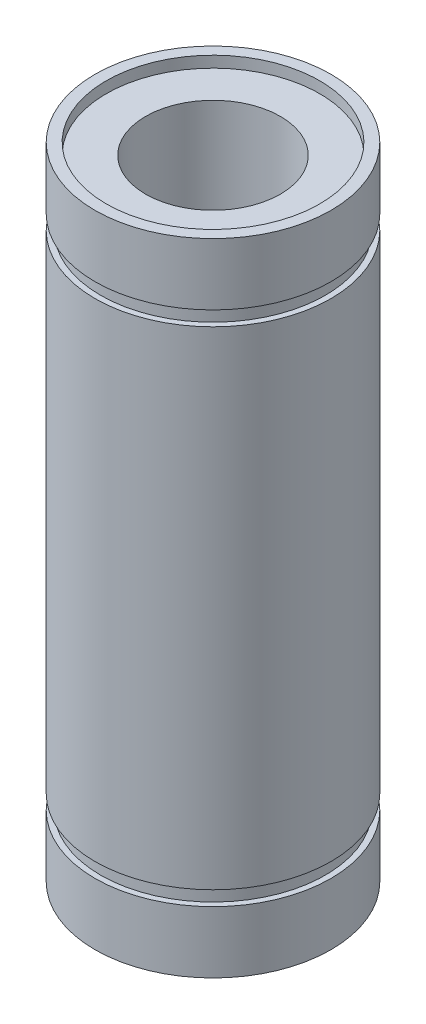
ISO-10303-21;
HEADER;
FILE_DESCRIPTION(('STEP AP214'),'2;1');
FILE_NAME('part.step','',(''),(''),'','','');
FILE_SCHEMA(('AUTOMOTIVE_DESIGN { 1 0 10303 214 1 1 1 1 }'));
ENDSEC;
DATA;
#1=APPLICATION_CONTEXT('core data for automotive mechanical design processes');
#2=APPLICATION_PROTOCOL_DEFINITION('international standard','automotive_design',2000,#1);
#3=PRODUCT_CONTEXT('',#1,'mechanical');
#4=PRODUCT('Part','Part','',(#3));
#5=PRODUCT_RELATED_PRODUCT_CATEGORY('part','',(#4));
#6=PRODUCT_DEFINITION_FORMATION('','',#4);
#7=PRODUCT_DEFINITION_CONTEXT('part definition',#1,'design');
#8=PRODUCT_DEFINITION('design','',#6,#7);
#9=PRODUCT_DEFINITION_SHAPE('','',#8);
#10=(LENGTH_UNIT() NAMED_UNIT(*) SI_UNIT(.MILLI.,.METRE.));
#11=(NAMED_UNIT(*) PLANE_ANGLE_UNIT() SI_UNIT($,.RADIAN.));
#12=(NAMED_UNIT(*) SI_UNIT($,.STERADIAN.) SOLID_ANGLE_UNIT());
#13=UNCERTAINTY_MEASURE_WITH_UNIT(LENGTH_MEASURE(1.E-05),#10,'distance_accuracy_value','');
#14=(GEOMETRIC_REPRESENTATION_CONTEXT(3) GLOBAL_UNCERTAINTY_ASSIGNED_CONTEXT((#13)) GLOBAL_UNIT_ASSIGNED_CONTEXT((#10,
#11,#12)) REPRESENTATION_CONTEXT('',''));
#15=CARTESIAN_POINT('',(0.,0.,0.));
#16=DIRECTION('',(0.,0.,1.));
#17=DIRECTION('',(1.,0.,0.));
#18=AXIS2_PLACEMENT_3D('',#15,#16,#17);
#19=CARTESIAN_POINT('',(0.,57.,0.));
#20=DIRECTION('',(0.,-1.,0.));
#21=DIRECTION('',(0.,0.,-1.));
#22=AXIS2_PLACEMENT_3D('',#19,#20,#21);
#23=CYLINDRICAL_SURFACE('',#22,10.5);
#24=CARTESIAN_POINT('',(0.,50.2,0.));
#25=DIRECTION('',(0.,1.,0.));
#26=DIRECTION('',(0.,0.,1.));
#27=AXIS2_PLACEMENT_3D('',#24,#25,#26);
#28=CIRCLE('',#27,10.5);
#29=CARTESIAN_POINT('',(0.,50.2,10.5));
#30=VERTEX_POINT('',#29);
#31=EDGE_CURVE('E72',#30,#30,#28,.T.);
#32=ORIENTED_EDGE('',*,*,#31,.F.);
#33=EDGE_LOOP('',(#32));
#34=FACE_BOUND('',#33,.T.);
#35=CARTESIAN_POINT('',(0.,6.8,0.));
#36=DIRECTION('',(0.,-1.,0.));
#37=DIRECTION('',(0.,0.,-1.));
#38=AXIS2_PLACEMENT_3D('',#35,#36,#37);
#39=CIRCLE('',#38,10.5);
#40=CARTESIAN_POINT('',(0.,6.8,-10.5));
#41=VERTEX_POINT('',#40);
#42=EDGE_CURVE('E47',#41,#41,#39,.T.);
#43=ORIENTED_EDGE('',*,*,#42,.F.);
#44=EDGE_LOOP('',(#43));
#45=FACE_BOUND('',#44,.T.);
#46=ADVANCED_FACE('F43',(#34,#45),#23,.T.);
#47=CARTESIAN_POINT('',(0.,5.5,0.));
#48=DIRECTION('',(0.,-1.,0.));
#49=DIRECTION('',(0.,0.,-1.));
#50=AXIS2_PLACEMENT_3D('',#47,#48,#49);
#51=CIRCLE('',#50,10.5);
#52=CARTESIAN_POINT('',(0.,5.5,-10.5));
#53=VERTEX_POINT('',#52);
#54=EDGE_CURVE('E76',#53,#53,#51,.T.);
#55=ORIENTED_EDGE('',*,*,#54,.T.);
#56=EDGE_LOOP('',(#55));
#57=FACE_BOUND('',#56,.T.);
#58=CARTESIAN_POINT('',(0.,0.,0.));
#59=DIRECTION('',(0.,1.,0.));
#60=DIRECTION('',(0.,0.,1.));
#61=AXIS2_PLACEMENT_3D('',#58,#59,#60);
#62=CIRCLE('',#61,10.5);
#63=CARTESIAN_POINT('',(0.,0.,10.5));
#64=VERTEX_POINT('',#63);
#65=EDGE_CURVE('E51',#64,#64,#62,.T.);
#66=ORIENTED_EDGE('',*,*,#65,.T.);
#67=EDGE_LOOP('',(#66));
#68=FACE_BOUND('',#67,.T.);
#69=ADVANCED_FACE('F117',(#57,#68),#23,.T.);
#70=CARTESIAN_POINT('',(0.,57.,0.));
#71=DIRECTION('',(0.,-1.,0.));
#72=DIRECTION('',(0.,0.,-1.));
#73=AXIS2_PLACEMENT_3D('',#70,#71,#72);
#74=CYLINDRICAL_SURFACE('',#73,6.);
#75=CARTESIAN_POINT('',(0.,56.,0.));
#76=DIRECTION('',(0.,1.,0.));
#77=DIRECTION('',(0.,0.,1.));
#78=AXIS2_PLACEMENT_3D('',#75,#76,#77);
#79=CIRCLE('',#78,6.);
#80=CARTESIAN_POINT('',(0.,56.,6.));
#81=VERTEX_POINT('',#80);
#82=EDGE_CURVE('E56',#81,#81,#79,.T.);
#83=ORIENTED_EDGE('',*,*,#82,.T.);
#84=EDGE_LOOP('',(#83));
#85=FACE_BOUND('',#84,.T.);
#86=CARTESIAN_POINT('',(0.,1.,0.));
#87=DIRECTION('',(0.,-1.,0.));
#88=DIRECTION('',(0.,0.,-1.));
#89=AXIS2_PLACEMENT_3D('',#86,#87,#88);
#90=CIRCLE('',#89,6.);
#91=CARTESIAN_POINT('',(0.,1.,-6.));
#92=VERTEX_POINT('',#91);
#93=EDGE_CURVE('E65',#92,#92,#90,.T.);
#94=ORIENTED_EDGE('',*,*,#93,.T.);
#95=EDGE_LOOP('',(#94));
#96=FACE_BOUND('',#95,.T.);
#97=ADVANCED_FACE('F109',(#85,#96),#74,.F.);
#98=CARTESIAN_POINT('',(0.,57.,0.));
#99=DIRECTION('',(0.,1.,0.));
#100=DIRECTION('',(0.,0.,1.));
#101=AXIS2_PLACEMENT_3D('',#98,#99,#100);
#102=PLANE('',#101);
#103=CARTESIAN_POINT('',(0.,57.,0.));
#104=DIRECTION('',(0.,1.,0.));
#105=DIRECTION('',(0.,0.,1.));
#106=AXIS2_PLACEMENT_3D('',#103,#104,#105);
#107=CIRCLE('',#106,9.5);
#108=CARTESIAN_POINT('',(0.,57.,9.5));
#109=VERTEX_POINT('',#108);
#110=EDGE_CURVE('E59',#109,#109,#107,.T.);
#111=ORIENTED_EDGE('',*,*,#110,.F.);
#112=EDGE_LOOP('',(#111));
#113=FACE_BOUND('',#112,.T.);
#114=CARTESIAN_POINT('',(0.,57.,0.));
#115=DIRECTION('',(0.,1.,0.));
#116=DIRECTION('',(0.,0.,1.));
#117=AXIS2_PLACEMENT_3D('',#114,#115,#116);
#118=CIRCLE('',#117,10.5);
#119=CARTESIAN_POINT('',(0.,57.,10.5));
#120=VERTEX_POINT('',#119);
#121=EDGE_CURVE('E11',#120,#120,#118,.T.);
#122=ORIENTED_EDGE('',*,*,#121,.T.);
#123=EDGE_LOOP('',(#122));
#124=FACE_BOUND('',#123,.T.);
#125=ADVANCED_FACE('F106',(#113,#124),#102,.T.);
#126=CARTESIAN_POINT('',(0.,0.,0.));
#127=DIRECTION('',(0.,1.,0.));
#128=DIRECTION('',(0.,0.,1.));
#129=AXIS2_PLACEMENT_3D('',#126,#127,#128);
#130=PLANE('',#129);
#131=CARTESIAN_POINT('',(0.,0.,0.));
#132=DIRECTION('',(0.,-1.,0.));
#133=DIRECTION('',(0.,0.,-1.));
#134=AXIS2_PLACEMENT_3D('',#131,#132,#133);
#135=CIRCLE('',#134,9.5);
#136=CARTESIAN_POINT('',(0.,0.,-9.5));
#137=VERTEX_POINT('',#136);
#138=EDGE_CURVE('E75',#137,#137,#135,.T.);
#139=ORIENTED_EDGE('',*,*,#138,.F.);
#140=EDGE_LOOP('',(#139));
#141=FACE_BOUND('',#140,.T.);
#142=ORIENTED_EDGE('',*,*,#65,.F.);
#143=EDGE_LOOP('',(#142));
#144=FACE_BOUND('',#143,.T.);
#145=ADVANCED_FACE('F108',(#141,#144),#130,.F.);
#146=CARTESIAN_POINT('',(0.,51.5,0.));
#147=DIRECTION('',(0.,1.,0.));
#148=DIRECTION('',(0.,0.,1.));
#149=AXIS2_PLACEMENT_3D('',#146,#147,#148);
#150=CIRCLE('',#149,10.5);
#151=CARTESIAN_POINT('',(0.,51.5,10.5));
#152=VERTEX_POINT('',#151);
#153=EDGE_CURVE('E69',#152,#152,#150,.T.);
#154=ORIENTED_EDGE('',*,*,#153,.T.);
#155=EDGE_LOOP('',(#154));
#156=FACE_BOUND('',#155,.T.);
#157=ORIENTED_EDGE('',*,*,#121,.F.);
#158=EDGE_LOOP('',(#157));
#159=FACE_BOUND('',#158,.T.);
#160=ADVANCED_FACE('F45',(#156,#159),#23,.T.);
#161=CARTESIAN_POINT('',(0.,56.,0.));
#162=DIRECTION('',(0.,1.,0.));
#163=DIRECTION('',(0.,0.,1.));
#164=AXIS2_PLACEMENT_3D('',#161,#162,#163);
#165=CYLINDRICAL_SURFACE('',#164,9.5);
#166=CARTESIAN_POINT('',(0.,56.,0.));
#167=DIRECTION('',(0.,1.,0.));
#168=DIRECTION('',(0.,0.,1.));
#169=AXIS2_PLACEMENT_3D('',#166,#167,#168);
#170=CIRCLE('',#169,9.5);
#171=CARTESIAN_POINT('',(0.,56.,9.5));
#172=VERTEX_POINT('',#171);
#173=EDGE_CURVE('E64',#172,#172,#170,.T.);
#174=ORIENTED_EDGE('',*,*,#173,.F.);
#175=EDGE_LOOP('',(#174));
#176=FACE_BOUND('',#175,.T.);
#177=ORIENTED_EDGE('',*,*,#110,.T.);
#178=EDGE_LOOP('',(#177));
#179=FACE_BOUND('',#178,.T.);
#180=ADVANCED_FACE('F104',(#176,#179),#165,.F.);
#181=CARTESIAN_POINT('',(0.,56.,0.));
#182=DIRECTION('',(0.,1.,0.));
#183=DIRECTION('',(0.,0.,1.));
#184=AXIS2_PLACEMENT_3D('',#181,#182,#183);
#185=PLANE('',#184);
#186=ORIENTED_EDGE('',*,*,#82,.F.);
#187=EDGE_LOOP('',(#186));
#188=FACE_BOUND('',#187,.T.);
#189=ORIENTED_EDGE('',*,*,#173,.T.);
#190=EDGE_LOOP('',(#189));
#191=FACE_BOUND('',#190,.T.);
#192=ADVANCED_FACE('F134',(#188,#191),#185,.T.);
#193=CARTESIAN_POINT('',(0.,1.,0.));
#194=DIRECTION('',(0.,-1.,0.));
#195=DIRECTION('',(0.,0.,-1.));
#196=AXIS2_PLACEMENT_3D('',#193,#194,#195);
#197=CYLINDRICAL_SURFACE('',#196,9.5);
#198=CARTESIAN_POINT('',(0.,1.,0.));
#199=DIRECTION('',(0.,-1.,0.));
#200=DIRECTION('',(0.,0.,-1.));
#201=AXIS2_PLACEMENT_3D('',#198,#199,#200);
#202=CIRCLE('',#201,9.5);
#203=CARTESIAN_POINT('',(0.,1.,-9.5));
#204=VERTEX_POINT('',#203);
#205=EDGE_CURVE('E68',#204,#204,#202,.T.);
#206=ORIENTED_EDGE('',*,*,#205,.F.);
#207=EDGE_LOOP('',(#206));
#208=FACE_BOUND('',#207,.T.);
#209=ORIENTED_EDGE('',*,*,#138,.T.);
#210=EDGE_LOOP('',(#209));
#211=FACE_BOUND('',#210,.T.);
#212=ADVANCED_FACE('F157',(#208,#211),#197,.F.);
#213=CARTESIAN_POINT('',(0.,1.,0.));
#214=DIRECTION('',(0.,-1.,0.));
#215=DIRECTION('',(0.,0.,-1.));
#216=AXIS2_PLACEMENT_3D('',#213,#214,#215);
#217=PLANE('',#216);
#218=ORIENTED_EDGE('',*,*,#93,.F.);
#219=EDGE_LOOP('',(#218));
#220=FACE_BOUND('',#219,.T.);
#221=ORIENTED_EDGE('',*,*,#205,.T.);
#222=EDGE_LOOP('',(#221));
#223=FACE_BOUND('',#222,.T.);
#224=ADVANCED_FACE('F151',(#220,#223),#217,.T.);
#225=CARTESIAN_POINT('',(0.,50.2,0.));
#226=DIRECTION('',(0.,1.,0.));
#227=DIRECTION('',(0.,0.,1.));
#228=AXIS2_PLACEMENT_3D('',#225,#226,#227);
#229=PLANE('',#228);
#230=CARTESIAN_POINT('',(0.,50.2,0.));
#231=DIRECTION('',(0.,1.,0.));
#232=DIRECTION('',(0.,0.,1.));
#233=AXIS2_PLACEMENT_3D('',#230,#231,#232);
#234=CIRCLE('',#233,10.);
#235=CARTESIAN_POINT('',(0.,50.2,10.));
#236=VERTEX_POINT('',#235);
#237=EDGE_CURVE('E73',#236,#236,#234,.T.);
#238=ORIENTED_EDGE('',*,*,#237,.F.);
#239=EDGE_LOOP('',(#238));
#240=FACE_BOUND('',#239,.T.);
#241=ORIENTED_EDGE('',*,*,#31,.T.);
#242=EDGE_LOOP('',(#241));
#243=FACE_BOUND('',#242,.T.);
#244=ADVANCED_FACE('F143',(#240,#243),#229,.T.);
#245=CARTESIAN_POINT('',(0.,51.5,0.));
#246=DIRECTION('',(0.,1.,0.));
#247=DIRECTION('',(0.,0.,1.));
#248=AXIS2_PLACEMENT_3D('',#245,#246,#247);
#249=PLANE('',#248);
#250=CARTESIAN_POINT('',(0.,51.5,0.));
#251=DIRECTION('',(0.,1.,0.));
#252=DIRECTION('',(0.,0.,1.));
#253=AXIS2_PLACEMENT_3D('',#250,#251,#252);
#254=CIRCLE('',#253,10.);
#255=CARTESIAN_POINT('',(0.,51.5,10.));
#256=VERTEX_POINT('',#255);
#257=EDGE_CURVE('E82',#256,#256,#254,.T.);
#258=ORIENTED_EDGE('',*,*,#257,.T.);
#259=EDGE_LOOP('',(#258));
#260=FACE_BOUND('',#259,.T.);
#261=ORIENTED_EDGE('',*,*,#153,.F.);
#262=EDGE_LOOP('',(#261));
#263=FACE_BOUND('',#262,.T.);
#264=ADVANCED_FACE('F140',(#260,#263),#249,.F.);
#265=CARTESIAN_POINT('',(0.,50.2,0.));
#266=DIRECTION('',(0.,1.,0.));
#267=DIRECTION('',(0.,0.,1.));
#268=AXIS2_PLACEMENT_3D('',#265,#266,#267);
#269=CYLINDRICAL_SURFACE('',#268,10.);
#270=ORIENTED_EDGE('',*,*,#237,.T.);
#271=EDGE_LOOP('',(#270));
#272=FACE_BOUND('',#271,.T.);
#273=ORIENTED_EDGE('',*,*,#257,.F.);
#274=EDGE_LOOP('',(#273));
#275=FACE_BOUND('',#274,.T.);
#276=ADVANCED_FACE('F142',(#272,#275),#269,.T.);
#277=CARTESIAN_POINT('',(0.,6.8,0.));
#278=DIRECTION('',(0.,-1.,0.));
#279=DIRECTION('',(0.,0.,-1.));
#280=AXIS2_PLACEMENT_3D('',#277,#278,#279);
#281=PLANE('',#280);
#282=CARTESIAN_POINT('',(0.,6.8,0.));
#283=DIRECTION('',(0.,-1.,0.));
#284=DIRECTION('',(0.,0.,-1.));
#285=AXIS2_PLACEMENT_3D('',#282,#283,#284);
#286=CIRCLE('',#285,10.);
#287=CARTESIAN_POINT('',(0.,6.8,-10.));
#288=VERTEX_POINT('',#287);
#289=EDGE_CURVE('E78',#288,#288,#286,.T.);
#290=ORIENTED_EDGE('',*,*,#289,.F.);
#291=EDGE_LOOP('',(#290));
#292=FACE_BOUND('',#291,.T.);
#293=ORIENTED_EDGE('',*,*,#42,.T.);
#294=EDGE_LOOP('',(#293));
#295=FACE_BOUND('',#294,.T.);
#296=ADVANCED_FACE('F148',(#292,#295),#281,.T.);
#297=CARTESIAN_POINT('',(0.,5.5,0.));
#298=DIRECTION('',(0.,-1.,0.));
#299=DIRECTION('',(0.,0.,-1.));
#300=AXIS2_PLACEMENT_3D('',#297,#298,#299);
#301=PLANE('',#300);
#302=CARTESIAN_POINT('',(0.,5.5,0.));
#303=DIRECTION('',(0.,-1.,0.));
#304=DIRECTION('',(0.,0.,-1.));
#305=AXIS2_PLACEMENT_3D('',#302,#303,#304);
#306=CIRCLE('',#305,10.);
#307=CARTESIAN_POINT('',(0.,5.5,-10.));
#308=VERTEX_POINT('',#307);
#309=EDGE_CURVE('E84',#308,#308,#306,.T.);
#310=ORIENTED_EDGE('',*,*,#309,.T.);
#311=EDGE_LOOP('',(#310));
#312=FACE_BOUND('',#311,.T.);
#313=ORIENTED_EDGE('',*,*,#54,.F.);
#314=EDGE_LOOP('',(#313));
#315=FACE_BOUND('',#314,.T.);
#316=ADVANCED_FACE('F228',(#312,#315),#301,.F.);
#317=CARTESIAN_POINT('',(0.,6.8,0.));
#318=DIRECTION('',(0.,-1.,0.));
#319=DIRECTION('',(0.,0.,-1.));
#320=AXIS2_PLACEMENT_3D('',#317,#318,#319);
#321=CYLINDRICAL_SURFACE('',#320,10.);
#322=ORIENTED_EDGE('',*,*,#289,.T.);
#323=EDGE_LOOP('',(#322));
#324=FACE_BOUND('',#323,.T.);
#325=ORIENTED_EDGE('',*,*,#309,.F.);
#326=EDGE_LOOP('',(#325));
#327=FACE_BOUND('',#326,.T.);
#328=ADVANCED_FACE('F236',(#324,#327),#321,.T.);
#329=CLOSED_SHELL('',(#46,#69,#97,#125,#145,#160,#180,#192,#212,#224,#244,#264,#276,#296,#316,#328));
#330=MANIFOLD_SOLID_BREP('B2',#329);
#331=ADVANCED_BREP_SHAPE_REPRESENTATION('',(#18,#330),#14);
#332=SHAPE_DEFINITION_REPRESENTATION(#9,#331);
ENDSEC;
END-ISO-10303-21;
